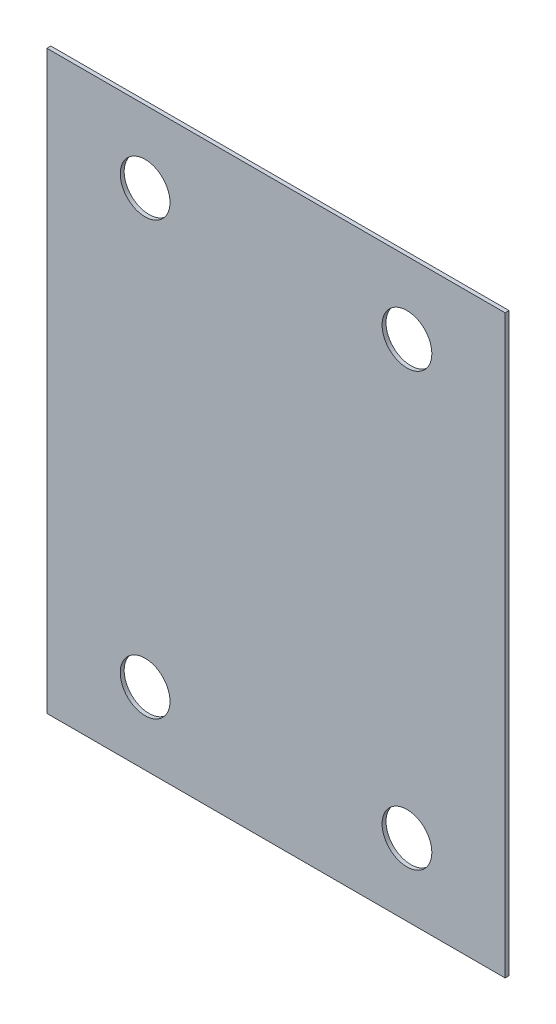
ISO-10303-21;
HEADER;
FILE_DESCRIPTION(('STEP AP214'),'2;1');
FILE_NAME('part.step','',(''),(''),'','','');
FILE_SCHEMA(('AUTOMOTIVE_DESIGN { 1 0 10303 214 1 1 1 1 }'));
ENDSEC;
DATA;
#1=APPLICATION_CONTEXT('core data for automotive mechanical design processes');
#2=APPLICATION_PROTOCOL_DEFINITION('international standard','automotive_design',2000,#1);
#3=PRODUCT_CONTEXT('',#1,'mechanical');
#4=PRODUCT('Part','Part','',(#3));
#5=PRODUCT_RELATED_PRODUCT_CATEGORY('part','',(#4));
#6=PRODUCT_DEFINITION_FORMATION('','',#4);
#7=PRODUCT_DEFINITION_CONTEXT('part definition',#1,'design');
#8=PRODUCT_DEFINITION('design','',#6,#7);
#9=PRODUCT_DEFINITION_SHAPE('','',#8);
#10=(LENGTH_UNIT() NAMED_UNIT(*) SI_UNIT(.MILLI.,.METRE.));
#11=(NAMED_UNIT(*) PLANE_ANGLE_UNIT() SI_UNIT($,.RADIAN.));
#12=(NAMED_UNIT(*) SI_UNIT($,.STERADIAN.) SOLID_ANGLE_UNIT());
#13=UNCERTAINTY_MEASURE_WITH_UNIT(LENGTH_MEASURE(1.E-05),#10,'distance_accuracy_value','');
#14=(GEOMETRIC_REPRESENTATION_CONTEXT(3) GLOBAL_UNCERTAINTY_ASSIGNED_CONTEXT((#13)) GLOBAL_UNIT_ASSIGNED_CONTEXT((#10,
#11,#12)) REPRESENTATION_CONTEXT('',''));
#15=CARTESIAN_POINT('',(0.,0.,0.));
#16=DIRECTION('',(0.,0.,1.));
#17=DIRECTION('',(1.,0.,0.));
#18=AXIS2_PLACEMENT_3D('',#15,#16,#17);
#19=CARTESIAN_POINT('',(0.,0.,3.));
#20=DIRECTION('',(0.,0.,1.));
#21=DIRECTION('',(1.,0.,0.));
#22=AXIS2_PLACEMENT_3D('',#19,#20,#21);
#23=PLANE('',#22);
#24=CARTESIAN_POINT('',(100.,-165.,3.));
#25=DIRECTION('',(0.,0.,1.));
#26=DIRECTION('',(1.,0.,0.));
#27=AXIS2_PLACEMENT_3D('',#24,#25,#26);
#28=CIRCLE('',#27,19.);
#29=CARTESIAN_POINT('',(119.,-165.,3.));
#30=VERTEX_POINT('',#29);
#31=EDGE_CURVE('E121',#30,#30,#28,.T.);
#32=ORIENTED_EDGE('',*,*,#31,.F.);
#33=EDGE_LOOP('',(#32));
#34=FACE_BOUND('',#33,.T.);
#35=CARTESIAN_POINT('',(-100.,165.,3.));
#36=DIRECTION('',(0.,0.,1.));
#37=DIRECTION('',(1.,0.,0.));
#38=AXIS2_PLACEMENT_3D('',#35,#36,#37);
#39=CIRCLE('',#38,19.0000000000034);
#40=CARTESIAN_POINT('',(-80.9999999999966,165.,3.));
#41=VERTEX_POINT('',#40);
#42=EDGE_CURVE('E100',#41,#41,#39,.T.);
#43=ORIENTED_EDGE('',*,*,#42,.F.);
#44=EDGE_LOOP('',(#43));
#45=FACE_BOUND('',#44,.T.);
#46=DIRECTION('',(1.,0.,0.));
#47=VECTOR('',#46,1.);
#48=CARTESIAN_POINT('',(-175.,-220.,3.));
#49=LINE('',#48,#47);
#50=CARTESIAN_POINT('',(-175.,-220.,3.));
#51=VERTEX_POINT('',#50);
#52=CARTESIAN_POINT('',(175.,-220.,3.));
#53=VERTEX_POINT('',#52);
#54=EDGE_CURVE('E85',#51,#53,#49,.T.);
#55=ORIENTED_EDGE('',*,*,#54,.T.);
#56=DIRECTION('',(0.,1.,0.));
#57=VECTOR('',#56,1.);
#58=CARTESIAN_POINT('',(175.,-220.,3.));
#59=LINE('',#58,#57);
#60=CARTESIAN_POINT('',(175.,220.,3.));
#61=VERTEX_POINT('',#60);
#62=EDGE_CURVE('E80',#53,#61,#59,.T.);
#63=ORIENTED_EDGE('',*,*,#62,.T.);
#64=DIRECTION('',(-1.,0.,0.));
#65=VECTOR('',#64,1.);
#66=CARTESIAN_POINT('',(175.,220.,3.));
#67=LINE('',#66,#65);
#68=CARTESIAN_POINT('',(-175.,220.,3.));
#69=VERTEX_POINT('',#68);
#70=EDGE_CURVE('E83',#61,#69,#67,.T.);
#71=ORIENTED_EDGE('',*,*,#70,.T.);
#72=DIRECTION('',(0.,-1.,0.));
#73=VECTOR('',#72,1.);
#74=CARTESIAN_POINT('',(-175.,220.,3.));
#75=LINE('',#74,#73);
#76=EDGE_CURVE('E50',#69,#51,#75,.T.);
#77=ORIENTED_EDGE('',*,*,#76,.T.);
#78=EDGE_LOOP('',(#55,#63,#71,#77));
#79=FACE_BOUND('',#78,.T.);
#80=CARTESIAN_POINT('',(100.,165.,3.));
#81=DIRECTION('',(0.,0.,1.));
#82=DIRECTION('',(1.,0.,0.));
#83=AXIS2_PLACEMENT_3D('',#80,#81,#82);
#84=CIRCLE('',#83,18.999999999996);
#85=CARTESIAN_POINT('',(118.999999999996,165.,3.));
#86=VERTEX_POINT('',#85);
#87=EDGE_CURVE('E115',#86,#86,#84,.T.);
#88=ORIENTED_EDGE('',*,*,#87,.F.);
#89=EDGE_LOOP('',(#88));
#90=FACE_BOUND('',#89,.T.);
#91=CARTESIAN_POINT('',(-100.,-165.,3.));
#92=DIRECTION('',(0.,0.,1.));
#93=DIRECTION('',(1.,0.,0.));
#94=AXIS2_PLACEMENT_3D('',#91,#92,#93);
#95=CIRCLE('',#94,19.);
#96=CARTESIAN_POINT('',(-81.,-165.,3.));
#97=VERTEX_POINT('',#96);
#98=EDGE_CURVE('E127',#97,#97,#95,.T.);
#99=ORIENTED_EDGE('',*,*,#98,.F.);
#100=EDGE_LOOP('',(#99));
#101=FACE_BOUND('',#100,.T.);
#102=ADVANCED_FACE('F33',(#34,#45,#79,#90,#101),#23,.T.);
#103=CARTESIAN_POINT('',(0.,0.,0.));
#104=DIRECTION('',(0.,0.,1.));
#105=DIRECTION('',(1.,0.,0.));
#106=AXIS2_PLACEMENT_3D('',#103,#104,#105);
#107=PLANE('',#106);
#108=DIRECTION('',(1.,0.,0.));
#109=VECTOR('',#108,1.);
#110=CARTESIAN_POINT('',(-175.,-220.,0.));
#111=LINE('',#110,#109);
#112=CARTESIAN_POINT('',(-175.,-220.,0.));
#113=VERTEX_POINT('',#112);
#114=CARTESIAN_POINT('',(175.,-220.,0.));
#115=VERTEX_POINT('',#114);
#116=EDGE_CURVE('E97',#113,#115,#111,.T.);
#117=ORIENTED_EDGE('',*,*,#116,.F.);
#118=DIRECTION('',(0.,-1.,0.));
#119=VECTOR('',#118,1.);
#120=CARTESIAN_POINT('',(-175.,220.,0.));
#121=LINE('',#120,#119);
#122=CARTESIAN_POINT('',(-175.,220.,0.));
#123=VERTEX_POINT('',#122);
#124=EDGE_CURVE('E73',#123,#113,#121,.T.);
#125=ORIENTED_EDGE('',*,*,#124,.F.);
#126=DIRECTION('',(-1.,0.,0.));
#127=VECTOR('',#126,1.);
#128=CARTESIAN_POINT('',(175.,220.,0.));
#129=LINE('',#128,#127);
#130=CARTESIAN_POINT('',(175.,220.,0.));
#131=VERTEX_POINT('',#130);
#132=EDGE_CURVE('E67',#131,#123,#129,.T.);
#133=ORIENTED_EDGE('',*,*,#132,.F.);
#134=DIRECTION('',(0.,1.,0.));
#135=VECTOR('',#134,1.);
#136=CARTESIAN_POINT('',(175.,-220.,0.));
#137=LINE('',#136,#135);
#138=EDGE_CURVE('E89',#115,#131,#137,.T.);
#139=ORIENTED_EDGE('',*,*,#138,.F.);
#140=EDGE_LOOP('',(#117,#125,#133,#139));
#141=FACE_BOUND('',#140,.T.);
#142=CARTESIAN_POINT('',(-100.,165.,0.));
#143=DIRECTION('',(0.,0.,1.));
#144=DIRECTION('',(1.,0.,0.));
#145=AXIS2_PLACEMENT_3D('',#142,#143,#144);
#146=CIRCLE('',#145,19.0000000000034);
#147=CARTESIAN_POINT('',(-80.9999999999966,165.,0.));
#148=VERTEX_POINT('',#147);
#149=EDGE_CURVE('E112',#148,#148,#146,.T.);
#150=ORIENTED_EDGE('',*,*,#149,.T.);
#151=EDGE_LOOP('',(#150));
#152=FACE_BOUND('',#151,.T.);
#153=CARTESIAN_POINT('',(100.,165.,0.));
#154=DIRECTION('',(0.,0.,1.));
#155=DIRECTION('',(1.,0.,0.));
#156=AXIS2_PLACEMENT_3D('',#153,#154,#155);
#157=CIRCLE('',#156,18.999999999996);
#158=CARTESIAN_POINT('',(118.999999999996,165.,0.));
#159=VERTEX_POINT('',#158);
#160=EDGE_CURVE('E118',#159,#159,#157,.T.);
#161=ORIENTED_EDGE('',*,*,#160,.T.);
#162=EDGE_LOOP('',(#161));
#163=FACE_BOUND('',#162,.T.);
#164=CARTESIAN_POINT('',(100.,-165.,0.));
#165=DIRECTION('',(0.,0.,1.));
#166=DIRECTION('',(1.,0.,0.));
#167=AXIS2_PLACEMENT_3D('',#164,#165,#166);
#168=CIRCLE('',#167,19.);
#169=CARTESIAN_POINT('',(119.,-165.,0.));
#170=VERTEX_POINT('',#169);
#171=EDGE_CURVE('E124',#170,#170,#168,.T.);
#172=ORIENTED_EDGE('',*,*,#171,.T.);
#173=EDGE_LOOP('',(#172));
#174=FACE_BOUND('',#173,.T.);
#175=CARTESIAN_POINT('',(-100.,-165.,0.));
#176=DIRECTION('',(0.,0.,1.));
#177=DIRECTION('',(1.,0.,0.));
#178=AXIS2_PLACEMENT_3D('',#175,#176,#177);
#179=CIRCLE('',#178,19.);
#180=CARTESIAN_POINT('',(-81.,-165.,0.));
#181=VERTEX_POINT('',#180);
#182=EDGE_CURVE('E130',#181,#181,#179,.T.);
#183=ORIENTED_EDGE('',*,*,#182,.T.);
#184=EDGE_LOOP('',(#183));
#185=FACE_BOUND('',#184,.T.);
#186=ADVANCED_FACE('F108',(#141,#152,#163,#174,#185),#107,.F.);
#187=CARTESIAN_POINT('',(-175.,-220.,3.));
#188=DIRECTION('',(0.,1.,0.));
#189=DIRECTION('',(0.,0.,1.));
#190=AXIS2_PLACEMENT_3D('',#187,#188,#189);
#191=PLANE('',#190);
#192=ORIENTED_EDGE('',*,*,#116,.T.);
#193=DIRECTION('',(0.,0.,-1.));
#194=VECTOR('',#193,1.);
#195=CARTESIAN_POINT('',(175.,-220.,3.));
#196=LINE('',#195,#194);
#197=EDGE_CURVE('E11',#53,#115,#196,.T.);
#198=ORIENTED_EDGE('',*,*,#197,.F.);
#199=ORIENTED_EDGE('',*,*,#54,.F.);
#200=DIRECTION('',(0.,0.,-1.));
#201=VECTOR('',#200,1.);
#202=CARTESIAN_POINT('',(-175.,-220.,3.));
#203=LINE('',#202,#201);
#204=EDGE_CURVE('E93',#51,#113,#203,.T.);
#205=ORIENTED_EDGE('',*,*,#204,.T.);
#206=EDGE_LOOP('',(#192,#198,#199,#205));
#207=FACE_BOUND('',#206,.T.);
#208=ADVANCED_FACE('F35',(#207),#191,.F.);
#209=CARTESIAN_POINT('',(175.,-220.,3.));
#210=DIRECTION('',(-1.,0.,0.));
#211=DIRECTION('',(0.,0.,1.));
#212=AXIS2_PLACEMENT_3D('',#209,#210,#211);
#213=PLANE('',#212);
#214=ORIENTED_EDGE('',*,*,#138,.T.);
#215=DIRECTION('',(0.,0.,-1.));
#216=VECTOR('',#215,1.);
#217=CARTESIAN_POINT('',(175.,220.,3.));
#218=LINE('',#217,#216);
#219=EDGE_CURVE('E42',#61,#131,#218,.T.);
#220=ORIENTED_EDGE('',*,*,#219,.F.);
#221=ORIENTED_EDGE('',*,*,#62,.F.);
#222=ORIENTED_EDGE('',*,*,#197,.T.);
#223=EDGE_LOOP('',(#214,#220,#221,#222));
#224=FACE_BOUND('',#223,.T.);
#225=ADVANCED_FACE('F88',(#224),#213,.F.);
#226=CARTESIAN_POINT('',(175.,220.,3.));
#227=DIRECTION('',(0.,-1.,0.));
#228=DIRECTION('',(0.,0.,-1.));
#229=AXIS2_PLACEMENT_3D('',#226,#227,#228);
#230=PLANE('',#229);
#231=ORIENTED_EDGE('',*,*,#132,.T.);
#232=DIRECTION('',(0.,0.,-1.));
#233=VECTOR('',#232,1.);
#234=CARTESIAN_POINT('',(-175.,220.,3.));
#235=LINE('',#234,#233);
#236=EDGE_CURVE('E90',#69,#123,#235,.T.);
#237=ORIENTED_EDGE('',*,*,#236,.F.);
#238=ORIENTED_EDGE('',*,*,#70,.F.);
#239=ORIENTED_EDGE('',*,*,#219,.T.);
#240=EDGE_LOOP('',(#231,#237,#238,#239));
#241=FACE_BOUND('',#240,.T.);
#242=ADVANCED_FACE('F91',(#241),#230,.F.);
#243=CARTESIAN_POINT('',(-175.,220.,3.));
#244=DIRECTION('',(1.,0.,0.));
#245=DIRECTION('',(0.,0.,-1.));
#246=AXIS2_PLACEMENT_3D('',#243,#244,#245);
#247=PLANE('',#246);
#248=ORIENTED_EDGE('',*,*,#124,.T.);
#249=ORIENTED_EDGE('',*,*,#204,.F.);
#250=ORIENTED_EDGE('',*,*,#76,.F.);
#251=ORIENTED_EDGE('',*,*,#236,.T.);
#252=EDGE_LOOP('',(#248,#249,#250,#251));
#253=FACE_BOUND('',#252,.T.);
#254=ADVANCED_FACE('F105',(#253),#247,.F.);
#255=CARTESIAN_POINT('',(-100.,165.,3.));
#256=DIRECTION('',(0.,0.,-1.));
#257=DIRECTION('',(-1.,0.,0.));
#258=AXIS2_PLACEMENT_3D('',#255,#256,#257);
#259=CYLINDRICAL_SURFACE('',#258,19.0000000000034);
#260=ORIENTED_EDGE('',*,*,#42,.T.);
#261=EDGE_LOOP('',(#260));
#262=FACE_BOUND('',#261,.T.);
#263=ORIENTED_EDGE('',*,*,#149,.F.);
#264=EDGE_LOOP('',(#263));
#265=FACE_BOUND('',#264,.T.);
#266=ADVANCED_FACE('F149',(#262,#265),#259,.F.);
#267=CARTESIAN_POINT('',(100.,165.,3.));
#268=DIRECTION('',(0.,0.,-1.));
#269=DIRECTION('',(-1.,0.,0.));
#270=AXIS2_PLACEMENT_3D('',#267,#268,#269);
#271=CYLINDRICAL_SURFACE('',#270,18.999999999996);
#272=ORIENTED_EDGE('',*,*,#87,.T.);
#273=EDGE_LOOP('',(#272));
#274=FACE_BOUND('',#273,.T.);
#275=ORIENTED_EDGE('',*,*,#160,.F.);
#276=EDGE_LOOP('',(#275));
#277=FACE_BOUND('',#276,.T.);
#278=ADVANCED_FACE('F195',(#274,#277),#271,.F.);
#279=CARTESIAN_POINT('',(100.,-165.,3.));
#280=DIRECTION('',(0.,0.,-1.));
#281=DIRECTION('',(-1.,0.,0.));
#282=AXIS2_PLACEMENT_3D('',#279,#280,#281);
#283=CYLINDRICAL_SURFACE('',#282,19.);
#284=ORIENTED_EDGE('',*,*,#31,.T.);
#285=EDGE_LOOP('',(#284));
#286=FACE_BOUND('',#285,.T.);
#287=ORIENTED_EDGE('',*,*,#171,.F.);
#288=EDGE_LOOP('',(#287));
#289=FACE_BOUND('',#288,.T.);
#290=ADVANCED_FACE('F203',(#286,#289),#283,.F.);
#291=CARTESIAN_POINT('',(-100.,-165.,3.));
#292=DIRECTION('',(0.,0.,-1.));
#293=DIRECTION('',(-1.,0.,0.));
#294=AXIS2_PLACEMENT_3D('',#291,#292,#293);
#295=CYLINDRICAL_SURFACE('',#294,19.);
#296=ORIENTED_EDGE('',*,*,#98,.T.);
#297=EDGE_LOOP('',(#296));
#298=FACE_BOUND('',#297,.T.);
#299=ORIENTED_EDGE('',*,*,#182,.F.);
#300=EDGE_LOOP('',(#299));
#301=FACE_BOUND('',#300,.T.);
#302=ADVANCED_FACE('F136',(#298,#301),#295,.F.);
#303=CLOSED_SHELL('',(#102,#186,#208,#225,#242,#254,#266,#278,#290,#302));
#304=MANIFOLD_SOLID_BREP('B2',#303);
#305=ADVANCED_BREP_SHAPE_REPRESENTATION('',(#18,#304),#14);
#306=SHAPE_DEFINITION_REPRESENTATION(#9,#305);
ENDSEC;
END-ISO-10303-21;
